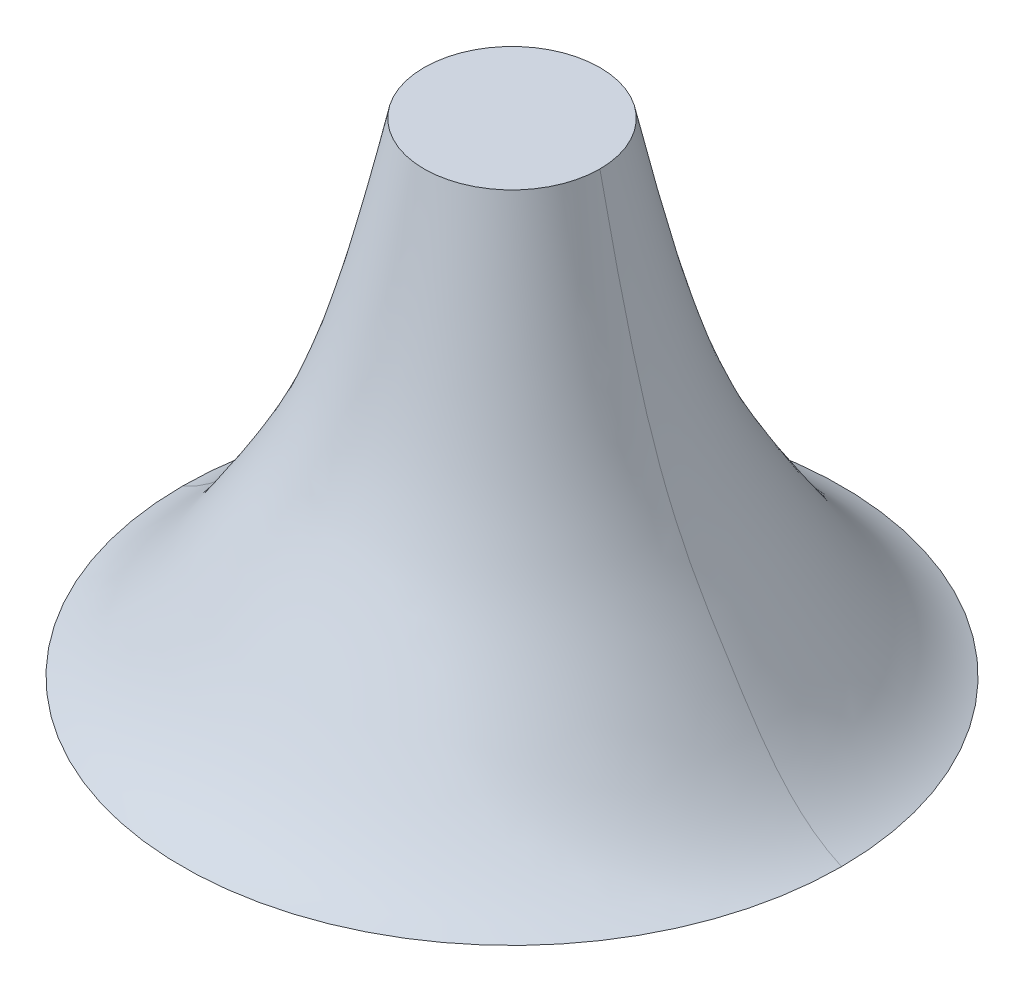
ISO-10303-21;
HEADER;
FILE_DESCRIPTION(('STEP AP214'),'2;1');
FILE_NAME('part.step','',(''),(''),'','','');
FILE_SCHEMA(('AUTOMOTIVE_DESIGN { 1 0 10303 214 1 1 1 1 }'));
ENDSEC;
DATA;
#1=APPLICATION_CONTEXT('core data for automotive mechanical design processes');
#2=APPLICATION_PROTOCOL_DEFINITION('international standard','automotive_design',2000,#1);
#3=PRODUCT_CONTEXT('',#1,'mechanical');
#4=PRODUCT('Part','Part','',(#3));
#5=PRODUCT_RELATED_PRODUCT_CATEGORY('part','',(#4));
#6=PRODUCT_DEFINITION_FORMATION('','',#4);
#7=PRODUCT_DEFINITION_CONTEXT('part definition',#1,'design');
#8=PRODUCT_DEFINITION('design','',#6,#7);
#9=PRODUCT_DEFINITION_SHAPE('','',#8);
#10=(LENGTH_UNIT() NAMED_UNIT(*) SI_UNIT(.MILLI.,.METRE.));
#11=(NAMED_UNIT(*) PLANE_ANGLE_UNIT() SI_UNIT($,.RADIAN.));
#12=(NAMED_UNIT(*) SI_UNIT($,.STERADIAN.) SOLID_ANGLE_UNIT());
#13=UNCERTAINTY_MEASURE_WITH_UNIT(LENGTH_MEASURE(1.E-05),#10,'distance_accuracy_value','');
#14=(GEOMETRIC_REPRESENTATION_CONTEXT(3) GLOBAL_UNCERTAINTY_ASSIGNED_CONTEXT((#13)) GLOBAL_UNIT_ASSIGNED_CONTEXT((#10,
#11,#12)) REPRESENTATION_CONTEXT('',''));
#15=CARTESIAN_POINT('',(0.,0.,0.));
#16=DIRECTION('',(0.,0.,1.));
#17=DIRECTION('',(1.,0.,0.));
#18=AXIS2_PLACEMENT_3D('',#15,#16,#17);
#19=CARTESIAN_POINT('',(-0.75,0.,0.));
#20=CARTESIAN_POINT('',(-0.75,0.,-1.5));
#21=CARTESIAN_POINT('',(0.75,0.,-1.5));
#22=CARTESIAN_POINT('',(0.75,0.,0.));
#23=CARTESIAN_POINT('',(-0.643509239460468,0.0465821339429968,0.));
#24=CARTESIAN_POINT('',(-0.643509239460468,0.0465821339429968,-1.28701847892094));
#25=CARTESIAN_POINT('',(0.643509239460468,0.0465821339429968,-1.28701847892094));
#26=CARTESIAN_POINT('',(0.643509239460468,0.0465821339429968,0.));
#27=CARTESIAN_POINT('',(-0.445765393470702,0.346632451573545,0.));
#28=CARTESIAN_POINT('',(-0.445765393470702,0.346632451573545,-0.891530786941405));
#29=CARTESIAN_POINT('',(0.445765393470702,0.346632451573545,-0.891530786941405));
#30=CARTESIAN_POINT('',(0.445765393470702,0.346632451573545,0.));
#31=CARTESIAN_POINT('',(-0.363727392719006,0.498738256185414,0.));
#32=CARTESIAN_POINT('',(-0.363727392719006,0.498738256185414,-0.727454785438011));
#33=CARTESIAN_POINT('',(0.363727392719005,0.498738256185414,-0.727454785438011));
#34=CARTESIAN_POINT('',(0.363727392719006,0.498738256185414,0.));
#35=CARTESIAN_POINT('',(-0.279321773596449,0.728999870644109,0.));
#36=CARTESIAN_POINT('',(-0.279321773596449,0.72899987064411,-0.558643547192899));
#37=CARTESIAN_POINT('',(0.279321773596449,0.72899987064411,-0.558643547192899));
#38=CARTESIAN_POINT('',(0.279321773596449,0.728999870644109,0.));
#39=CARTESIAN_POINT('',(-0.2,1.1,0.));
#40=CARTESIAN_POINT('',(-0.2,1.1,-0.4));
#41=CARTESIAN_POINT('',(0.2,1.1,-0.4));
#42=CARTESIAN_POINT('',(0.2,1.1,0.));
#43=(BOUNDED_SURFACE() B_SPLINE_SURFACE(3,3,((#19,#20,#21,#22),(#23,#24,#25,#26),(#27,#28,#29,
#30),(#31,#32,#33,#34),(#35,#36,#37,#38),(#39,#40,#41,#42)),.UNSPECIFIED.,.F.,.F.,
.F.) B_SPLINE_SURFACE_WITH_KNOTS((4,1,1,4),(4,4),(0.,0.195133985854239,0.559803605295588,1.),
(0.,1.),.UNSPECIFIED.) GEOMETRIC_REPRESENTATION_ITEM() RATIONAL_B_SPLINE_SURFACE(((1.,
0.333333333333334,0.333333333333334,1.),(1.,0.333333333333334,0.333333333333334,1.),(1.,
0.333333333333334,0.333333333333334,1.),(1.,0.333333333333334,0.333333333333334,1.),(1.,
0.333333333333334,0.333333333333334,1.),(1.,0.333333333333334,0.333333333333334,1.))) REPRESENTATION_ITEM('') SURFACE());
#44=CARTESIAN_POINT('',(0.,0.,0.));
#45=DIRECTION('',(0.,-1.,0.));
#46=DIRECTION('',(1.,0.,0.));
#47=AXIS2_PLACEMENT_3D('',#44,#45,#46);
#48=CIRCLE('',#47,0.75);
#49=CARTESIAN_POINT('',(-0.75,0.,0.));
#50=VERTEX_POINT('',#49);
#51=CARTESIAN_POINT('',(0.75,0.,0.));
#52=VERTEX_POINT('',#51);
#53=EDGE_CURVE('E40',#50,#52,#48,.T.);
#54=CARTESIAN_POINT('',(-0.75,0.,0.));
#55=CARTESIAN_POINT('',(-0.643509239460468,0.0465821339429968,0.));
#56=CARTESIAN_POINT('',(-0.445765393470702,0.346632451573545,0.));
#57=CARTESIAN_POINT('',(-0.363727392719006,0.498738256185414,0.));
#58=CARTESIAN_POINT('',(-0.279321773596449,0.728999870644109,0.));
#59=CARTESIAN_POINT('',(-0.2,1.1,0.));
#60=(BOUNDED_CURVE() B_SPLINE_CURVE(3,(#54,#55,#56,#57,#58,#59),.UNSPECIFIED.,.F.,
.F.) B_SPLINE_CURVE_WITH_KNOTS((4,1,1,4),(0.,0.195133985854239,0.559803605295588,1.),
.UNSPECIFIED.) CURVE() GEOMETRIC_REPRESENTATION_ITEM() RATIONAL_B_SPLINE_CURVE((1.,1.,1.,1.,1.,1.)) REPRESENTATION_ITEM(''));
#61=CARTESIAN_POINT('',(-0.2,1.1,0.));
#62=VERTEX_POINT('',#61);
#63=EDGE_CURVE('E11',#50,#62,#60,.T.);
#64=CARTESIAN_POINT('',(0.,1.1,0.));
#65=DIRECTION('',(0.,-1.,0.));
#66=DIRECTION('',(1.,0.,0.));
#67=AXIS2_PLACEMENT_3D('',#64,#65,#66);
#68=CIRCLE('',#67,0.2);
#69=CARTESIAN_POINT('',(0.2,1.1,0.));
#70=VERTEX_POINT('',#69);
#71=EDGE_CURVE('E20',#62,#70,#68,.T.);
#72=CARTESIAN_POINT('',(0.75,0.,0.));
#73=CARTESIAN_POINT('',(0.643509239460468,0.0465821339429968,0.));
#74=CARTESIAN_POINT('',(0.445765393470702,0.346632451573545,0.));
#75=CARTESIAN_POINT('',(0.363727392719006,0.498738256185414,0.));
#76=CARTESIAN_POINT('',(0.279321773596449,0.728999870644109,0.));
#77=CARTESIAN_POINT('',(0.2,1.1,0.));
#78=(BOUNDED_CURVE() B_SPLINE_CURVE(3,(#72,#73,#74,#75,#76,#77),.UNSPECIFIED.,.F.,
.F.) B_SPLINE_CURVE_WITH_KNOTS((4,1,1,4),(0.,0.195133985854239,0.559803605295588,1.),
.UNSPECIFIED.) CURVE() GEOMETRIC_REPRESENTATION_ITEM() RATIONAL_B_SPLINE_CURVE((1.,1.,1.,1.,1.,1.)) REPRESENTATION_ITEM(''));
#79=EDGE_CURVE('E50',#52,#70,#78,.T.);
#80=ORIENTED_EDGE('',*,*,#53,.F.);
#81=ORIENTED_EDGE('',*,*,#63,.T.);
#82=ORIENTED_EDGE('',*,*,#71,.T.);
#83=ORIENTED_EDGE('',*,*,#79,.F.);
#84=EDGE_LOOP('',(#80,#81,#82,#83));
#85=FACE_BOUND('',#84,.T.);
#86=ADVANCED_FACE('F16',(#85),#43,.T.);
#87=CARTESIAN_POINT('',(0.,0.,0.));
#88=DIRECTION('',(0.,-1.,0.));
#89=DIRECTION('',(-1.,0.,0.));
#90=AXIS2_PLACEMENT_3D('',#87,#88,#89);
#91=PLANE('',#90);
#92=CARTESIAN_POINT('',(0.,0.,0.));
#93=DIRECTION('',(0.,-1.,0.));
#94=DIRECTION('',(1.,0.,0.));
#95=AXIS2_PLACEMENT_3D('',#92,#93,#94);
#96=CIRCLE('',#95,0.75);
#97=EDGE_CURVE('E62',#52,#50,#96,.T.);
#98=ORIENTED_EDGE('',*,*,#97,.T.);
#99=ORIENTED_EDGE('',*,*,#53,.T.);
#100=EDGE_LOOP('',(#98,#99));
#101=FACE_BOUND('',#100,.T.);
#102=ADVANCED_FACE('F18',(#101),#91,.T.);
#103=CARTESIAN_POINT('',(0.,1.1,0.));
#104=DIRECTION('',(0.,1.,0.));
#105=DIRECTION('',(1.,0.,0.));
#106=AXIS2_PLACEMENT_3D('',#103,#104,#105);
#107=PLANE('',#106);
#108=CARTESIAN_POINT('',(0.,1.1,0.));
#109=DIRECTION('',(0.,-1.,0.));
#110=DIRECTION('',(1.,0.,0.));
#111=AXIS2_PLACEMENT_3D('',#108,#109,#110);
#112=CIRCLE('',#111,0.2);
#113=EDGE_CURVE('E60',#70,#62,#112,.T.);
#114=ORIENTED_EDGE('',*,*,#113,.F.);
#115=ORIENTED_EDGE('',*,*,#71,.F.);
#116=EDGE_LOOP('',(#114,#115));
#117=FACE_BOUND('',#116,.T.);
#118=ADVANCED_FACE('F67',(#117),#107,.T.);
#119=CARTESIAN_POINT('',(0.75,0.,0.));
#120=CARTESIAN_POINT('',(0.75,0.,1.5));
#121=CARTESIAN_POINT('',(-0.75,0.,1.5));
#122=CARTESIAN_POINT('',(-0.75,0.,0.));
#123=CARTESIAN_POINT('',(0.643509239460468,0.0465821339429968,0.));
#124=CARTESIAN_POINT('',(0.643509239460468,0.0465821339429968,1.28701847892094));
#125=CARTESIAN_POINT('',(-0.643509239460468,0.0465821339429968,1.28701847892094));
#126=CARTESIAN_POINT('',(-0.643509239460468,0.0465821339429968,0.));
#127=CARTESIAN_POINT('',(0.445765393470702,0.346632451573545,0.));
#128=CARTESIAN_POINT('',(0.445765393470702,0.346632451573545,0.891530786941405));
#129=CARTESIAN_POINT('',(-0.445765393470702,0.346632451573545,0.891530786941405));
#130=CARTESIAN_POINT('',(-0.445765393470702,0.346632451573545,0.));
#131=CARTESIAN_POINT('',(0.363727392719006,0.498738256185414,0.));
#132=CARTESIAN_POINT('',(0.363727392719005,0.498738256185414,0.727454785438011));
#133=CARTESIAN_POINT('',(-0.363727392719005,0.498738256185414,0.727454785438011));
#134=CARTESIAN_POINT('',(-0.363727392719006,0.498738256185414,0.));
#135=CARTESIAN_POINT('',(0.279321773596449,0.728999870644109,0.));
#136=CARTESIAN_POINT('',(0.279321773596449,0.72899987064411,0.558643547192899));
#137=CARTESIAN_POINT('',(-0.279321773596449,0.72899987064411,0.558643547192899));
#138=CARTESIAN_POINT('',(-0.279321773596449,0.728999870644109,0.));
#139=CARTESIAN_POINT('',(0.2,1.1,0.));
#140=CARTESIAN_POINT('',(0.2,1.1,0.4));
#141=CARTESIAN_POINT('',(-0.2,1.1,0.4));
#142=CARTESIAN_POINT('',(-0.2,1.1,0.));
#143=(BOUNDED_SURFACE() B_SPLINE_SURFACE(3,3,((#119,#120,#121,#122),(#123,#124,#125,#126),(#127,
#128,#129,#130),(#131,#132,#133,#134),(#135,#136,#137,#138),(#139,#140,#141,#142)),
.UNSPECIFIED.,.F.,.F.,.F.) B_SPLINE_SURFACE_WITH_KNOTS((4,1,1,4),(4,4),(0.,0.195133985854239,
0.559803605295588,1.),(0.,1.),
.UNSPECIFIED.) GEOMETRIC_REPRESENTATION_ITEM() RATIONAL_B_SPLINE_SURFACE(((1.,0.333333333333334,
0.333333333333334,1.),(1.,0.333333333333334,0.333333333333334,1.),(1.,0.333333333333334,
0.333333333333334,1.),(1.,0.333333333333334,0.333333333333334,1.),(1.,0.333333333333334,
0.333333333333334,1.),(1.,0.333333333333334,0.333333333333334,1.))) REPRESENTATION_ITEM('') SURFACE());
#144=ORIENTED_EDGE('',*,*,#63,.F.);
#145=ORIENTED_EDGE('',*,*,#97,.F.);
#146=ORIENTED_EDGE('',*,*,#79,.T.);
#147=ORIENTED_EDGE('',*,*,#113,.T.);
#148=EDGE_LOOP('',(#144,#145,#146,#147));
#149=FACE_BOUND('',#148,.T.);
#150=ADVANCED_FACE('F58',(#149),#143,.T.);
#151=CLOSED_SHELL('',(#86,#102,#118,#150));
#152=MANIFOLD_SOLID_BREP('B1',#151);
#153=ADVANCED_BREP_SHAPE_REPRESENTATION('',(#18,#152),#14);
#154=SHAPE_DEFINITION_REPRESENTATION(#9,#153);
ENDSEC;
END-ISO-10303-21;
